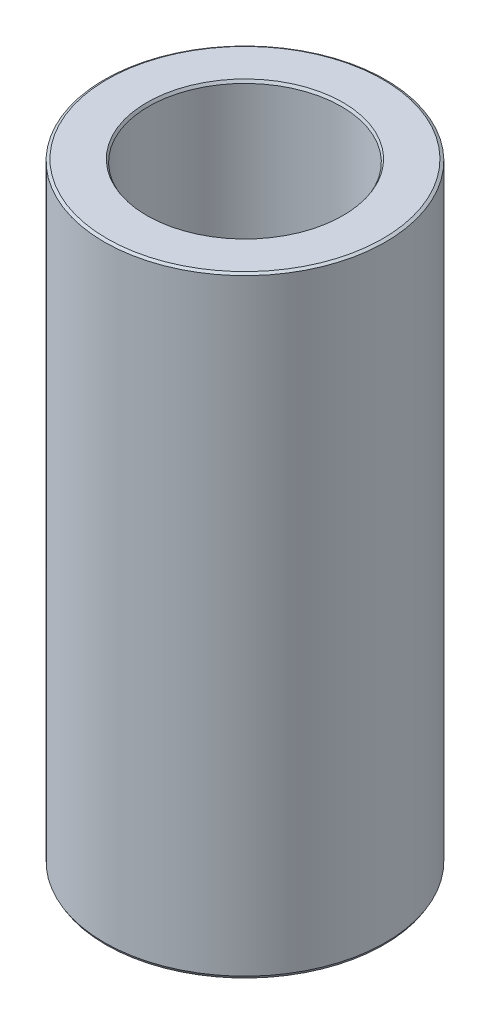
ISO-10303-21;
HEADER;
FILE_DESCRIPTION(('STEP AP214'),'2;1');
FILE_NAME('part.step','',(''),(''),'','','');
FILE_SCHEMA(('AUTOMOTIVE_DESIGN { 1 0 10303 214 1 1 1 1 }'));
ENDSEC;
DATA;
#1=APPLICATION_CONTEXT('core data for automotive mechanical design processes');
#2=APPLICATION_PROTOCOL_DEFINITION('international standard','automotive_design',2000,#1);
#3=PRODUCT_CONTEXT('',#1,'mechanical');
#4=PRODUCT('Part','Part','',(#3));
#5=PRODUCT_RELATED_PRODUCT_CATEGORY('part','',(#4));
#6=PRODUCT_DEFINITION_FORMATION('','',#4);
#7=PRODUCT_DEFINITION_CONTEXT('part definition',#1,'design');
#8=PRODUCT_DEFINITION('design','',#6,#7);
#9=PRODUCT_DEFINITION_SHAPE('','',#8);
#10=(LENGTH_UNIT() NAMED_UNIT(*) SI_UNIT(.MILLI.,.METRE.));
#11=(NAMED_UNIT(*) PLANE_ANGLE_UNIT() SI_UNIT($,.RADIAN.));
#12=(NAMED_UNIT(*) SI_UNIT($,.STERADIAN.) SOLID_ANGLE_UNIT());
#13=UNCERTAINTY_MEASURE_WITH_UNIT(LENGTH_MEASURE(1.E-05),#10,'distance_accuracy_value','');
#14=(GEOMETRIC_REPRESENTATION_CONTEXT(3) GLOBAL_UNCERTAINTY_ASSIGNED_CONTEXT((#13)) GLOBAL_UNIT_ASSIGNED_CONTEXT((#10,
#11,#12)) REPRESENTATION_CONTEXT('',''));
#15=CARTESIAN_POINT('',(0.,0.,0.));
#16=DIRECTION('',(0.,0.,1.));
#17=DIRECTION('',(1.,0.,0.));
#18=AXIS2_PLACEMENT_3D('',#15,#16,#17);
#19=CARTESIAN_POINT('',(0.,108.605377155582,0.));
#20=DIRECTION('',(0.,-1.,0.));
#21=DIRECTION('',(0.,0.,-1.));
#22=AXIS2_PLACEMENT_3D('',#19,#20,#21);
#23=CYLINDRICAL_SURFACE('',#22,25.);
#24=CARTESIAN_POINT('',(0.,0.484902644162677,0.));
#25=DIRECTION('',(0.,1.,0.));
#26=DIRECTION('',(0.,0.,1.));
#27=AXIS2_PLACEMENT_3D('',#24,#25,#26);
#28=CIRCLE('',#27,25.);
#29=CARTESIAN_POINT('',(0.,0.484902644162677,25.));
#30=VERTEX_POINT('',#29);
#31=EDGE_CURVE('E10',#30,#30,#28,.T.);
#32=ORIENTED_EDGE('',*,*,#31,.T.);
#33=EDGE_LOOP('',(#32));
#34=FACE_BOUND('',#33,.T.);
#35=CARTESIAN_POINT('',(0.,108.325418483444,0.));
#36=DIRECTION('',(0.,1.,0.));
#37=DIRECTION('',(0.,0.,1.));
#38=AXIS2_PLACEMENT_3D('',#35,#36,#37);
#39=CIRCLE('',#38,25.);
#40=CARTESIAN_POINT('',(0.,108.325418483444,25.));
#41=VERTEX_POINT('',#40);
#42=EDGE_CURVE('E50',#41,#41,#39,.F.);
#43=ORIENTED_EDGE('',*,*,#42,.T.);
#44=EDGE_LOOP('',(#43));
#45=FACE_BOUND('',#44,.T.);
#46=ADVANCED_FACE('F39',(#34,#45),#23,.T.);
#47=CARTESIAN_POINT('',(0.,108.605377155582,0.));
#48=DIRECTION('',(0.,1.,0.));
#49=DIRECTION('',(0.,0.,1.));
#50=AXIS2_PLACEMENT_3D('',#47,#48,#49);
#51=PLANE('',#50);
#52=CARTESIAN_POINT('',(0.,108.605377155582,0.));
#53=DIRECTION('',(0.,1.,0.));
#54=DIRECTION('',(0.,0.,1.));
#55=AXIS2_PLACEMENT_3D('',#52,#53,#54);
#56=CIRCLE('',#55,17.4284853797805);
#57=CARTESIAN_POINT('',(0.,108.605377155582,17.4284853797805));
#58=VERTEX_POINT('',#57);
#59=EDGE_CURVE('E58',#58,#58,#56,.F.);
#60=ORIENTED_EDGE('',*,*,#59,.T.);
#61=EDGE_LOOP('',(#60));
#62=FACE_BOUND('',#61,.T.);
#63=CARTESIAN_POINT('',(0.,108.605377155582,0.));
#64=DIRECTION('',(0.,1.,0.));
#65=DIRECTION('',(0.,0.,1.));
#66=AXIS2_PLACEMENT_3D('',#63,#64,#65);
#67=CIRCLE('',#66,24.5150973558373);
#68=CARTESIAN_POINT('',(0.,108.605377155582,24.5150973558373));
#69=VERTEX_POINT('',#68);
#70=EDGE_CURVE('E61',#69,#69,#67,.T.);
#71=ORIENTED_EDGE('',*,*,#70,.T.);
#72=EDGE_LOOP('',(#71));
#73=FACE_BOUND('',#72,.T.);
#74=ADVANCED_FACE('F88',(#62,#73),#51,.T.);
#75=CARTESIAN_POINT('',(0.,0.,0.));
#76=DIRECTION('',(0.,1.,0.));
#77=DIRECTION('',(0.,0.,1.));
#78=AXIS2_PLACEMENT_3D('',#75,#76,#77);
#79=PLANE('',#78);
#80=CARTESIAN_POINT('',(0.,0.,0.));
#81=DIRECTION('',(0.,1.,0.));
#82=DIRECTION('',(0.,0.,1.));
#83=AXIS2_PLACEMENT_3D('',#80,#81,#82);
#84=CIRCLE('',#83,17.6334293518051);
#85=CARTESIAN_POINT('',(0.,0.,17.6334293518051));
#86=VERTEX_POINT('',#85);
#87=EDGE_CURVE('E51',#86,#86,#84,.T.);
#88=ORIENTED_EDGE('',*,*,#87,.T.);
#89=EDGE_LOOP('',(#88));
#90=FACE_BOUND('',#89,.T.);
#91=CARTESIAN_POINT('',(0.,0.,0.));
#92=DIRECTION('',(0.,1.,0.));
#93=DIRECTION('',(0.,0.,1.));
#94=AXIS2_PLACEMENT_3D('',#91,#92,#93);
#95=CIRCLE('',#94,24.7200413278619);
#96=CARTESIAN_POINT('',(0.,0.,24.7200413278619));
#97=VERTEX_POINT('',#96);
#98=EDGE_CURVE('E54',#97,#97,#95,.F.);
#99=ORIENTED_EDGE('',*,*,#98,.T.);
#100=EDGE_LOOP('',(#99));
#101=FACE_BOUND('',#100,.T.);
#102=ADVANCED_FACE('F83',(#90,#101),#79,.F.);
#103=CARTESIAN_POINT('',(0.,108.605377155582,0.));
#104=DIRECTION('',(0.,-1.,0.));
#105=DIRECTION('',(0.,0.,-1.));
#106=AXIS2_PLACEMENT_3D('',#103,#104,#105);
#107=CYLINDRICAL_SURFACE('',#106,17.1485267076424);
#108=CARTESIAN_POINT('',(0.,108.120474511419,0.));
#109=DIRECTION('',(0.,1.,0.));
#110=DIRECTION('',(0.,0.,1.));
#111=AXIS2_PLACEMENT_3D('',#108,#109,#110);
#112=CIRCLE('',#111,17.1485267076424);
#113=CARTESIAN_POINT('',(0.,108.120474511419,17.1485267076424));
#114=VERTEX_POINT('',#113);
#115=EDGE_CURVE('E67',#114,#114,#112,.T.);
#116=ORIENTED_EDGE('',*,*,#115,.T.);
#117=EDGE_LOOP('',(#116));
#118=FACE_BOUND('',#117,.T.);
#119=CARTESIAN_POINT('',(0.,0.279958672138092,0.));
#120=DIRECTION('',(0.,1.,0.));
#121=DIRECTION('',(0.,0.,1.));
#122=AXIS2_PLACEMENT_3D('',#119,#120,#121);
#123=CIRCLE('',#122,17.1485267076424);
#124=CARTESIAN_POINT('',(0.,0.279958672138092,17.1485267076424));
#125=VERTEX_POINT('',#124);
#126=EDGE_CURVE('E69',#125,#125,#123,.F.);
#127=ORIENTED_EDGE('',*,*,#126,.T.);
#128=EDGE_LOOP('',(#127));
#129=FACE_BOUND('',#128,.T.);
#130=ADVANCED_FACE('F71',(#118,#129),#107,.F.);
#131=CARTESIAN_POINT('',(0.,108.120474511419,0.));
#132=DIRECTION('',(0.,1.,0.));
#133=DIRECTION('',(0.,0.,1.));
#134=AXIS2_PLACEMENT_3D('',#131,#132,#133);
#135=CONICAL_SURFACE('',#134,17.1485267076424,0.523598775598297);
#136=ORIENTED_EDGE('',*,*,#59,.F.);
#137=EDGE_LOOP('',(#136));
#138=FACE_BOUND('',#137,.T.);
#139=ORIENTED_EDGE('',*,*,#115,.F.);
#140=EDGE_LOOP('',(#139));
#141=FACE_BOUND('',#140,.T.);
#142=ADVANCED_FACE('F77',(#138,#141),#135,.F.);
#143=CARTESIAN_POINT('',(0.,0.,0.));
#144=DIRECTION('',(0.,-1.,0.));
#145=DIRECTION('',(0.,0.,-1.));
#146=AXIS2_PLACEMENT_3D('',#143,#144,#145);
#147=CONICAL_SURFACE('',#146,17.6334293518051,1.04719755119661);
#148=ORIENTED_EDGE('',*,*,#126,.F.);
#149=EDGE_LOOP('',(#148));
#150=FACE_BOUND('',#149,.T.);
#151=ORIENTED_EDGE('',*,*,#87,.F.);
#152=EDGE_LOOP('',(#151));
#153=FACE_BOUND('',#152,.T.);
#154=ADVANCED_FACE('F73',(#150,#153),#147,.F.);
#155=CARTESIAN_POINT('',(0.,0.484902644162677,0.));
#156=DIRECTION('',(0.,1.,0.));
#157=DIRECTION('',(0.,0.,1.));
#158=AXIS2_PLACEMENT_3D('',#155,#156,#157);
#159=CONICAL_SURFACE('',#158,25.,0.523598775598302);
#160=ORIENTED_EDGE('',*,*,#98,.F.);
#161=EDGE_LOOP('',(#160));
#162=FACE_BOUND('',#161,.T.);
#163=ORIENTED_EDGE('',*,*,#31,.F.);
#164=EDGE_LOOP('',(#163));
#165=FACE_BOUND('',#164,.T.);
#166=ADVANCED_FACE('F76',(#162,#165),#159,.T.);
#167=CARTESIAN_POINT('',(0.,108.605377155582,0.));
#168=DIRECTION('',(0.,-1.,0.));
#169=DIRECTION('',(0.,0.,-1.));
#170=AXIS2_PLACEMENT_3D('',#167,#168,#169);
#171=CONICAL_SURFACE('',#170,24.5150973558373,1.04719755119659);
#172=ORIENTED_EDGE('',*,*,#42,.F.);
#173=EDGE_LOOP('',(#172));
#174=FACE_BOUND('',#173,.T.);
#175=ORIENTED_EDGE('',*,*,#70,.F.);
#176=EDGE_LOOP('',(#175));
#177=FACE_BOUND('',#176,.T.);
#178=ADVANCED_FACE('F45',(#174,#177),#171,.T.);
#179=CLOSED_SHELL('',(#46,#74,#102,#130,#142,#154,#166,#178));
#180=MANIFOLD_SOLID_BREP('B2',#179);
#181=ADVANCED_BREP_SHAPE_REPRESENTATION('',(#18,#180),#14);
#182=SHAPE_DEFINITION_REPRESENTATION(#9,#181);
ENDSEC;
END-ISO-10303-21;
